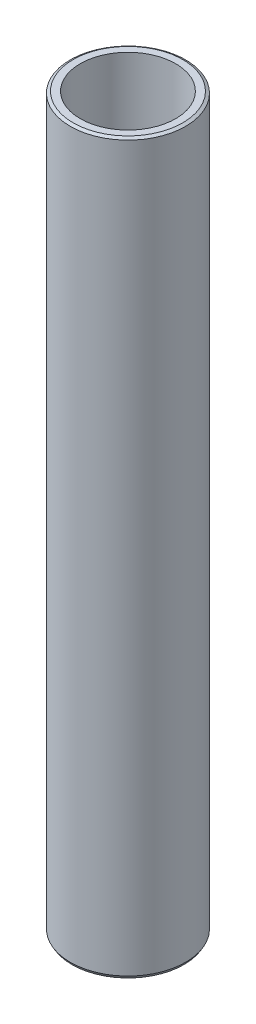
ISO-10303-21;
HEADER;
FILE_DESCRIPTION(('STEP AP214'),'2;1');
FILE_NAME('part.step','',(''),(''),'','','');
FILE_SCHEMA(('AUTOMOTIVE_DESIGN { 1 0 10303 214 1 1 1 1 }'));
ENDSEC;
DATA;
#1=APPLICATION_CONTEXT('core data for automotive mechanical design processes');
#2=APPLICATION_PROTOCOL_DEFINITION('international standard','automotive_design',2000,#1);
#3=PRODUCT_CONTEXT('',#1,'mechanical');
#4=PRODUCT('Part','Part','',(#3));
#5=PRODUCT_RELATED_PRODUCT_CATEGORY('part','',(#4));
#6=PRODUCT_DEFINITION_FORMATION('','',#4);
#7=PRODUCT_DEFINITION_CONTEXT('part definition',#1,'design');
#8=PRODUCT_DEFINITION('design','',#6,#7);
#9=PRODUCT_DEFINITION_SHAPE('','',#8);
#10=(LENGTH_UNIT() NAMED_UNIT(*) SI_UNIT(.MILLI.,.METRE.));
#11=(NAMED_UNIT(*) PLANE_ANGLE_UNIT() SI_UNIT($,.RADIAN.));
#12=(NAMED_UNIT(*) SI_UNIT($,.STERADIAN.) SOLID_ANGLE_UNIT());
#13=UNCERTAINTY_MEASURE_WITH_UNIT(LENGTH_MEASURE(1.E-05),#10,'distance_accuracy_value','');
#14=(GEOMETRIC_REPRESENTATION_CONTEXT(3) GLOBAL_UNCERTAINTY_ASSIGNED_CONTEXT((#13)) GLOBAL_UNIT_ASSIGNED_CONTEXT((#10,
#11,#12)) REPRESENTATION_CONTEXT('',''));
#15=CARTESIAN_POINT('',(0.,0.,0.));
#16=DIRECTION('',(0.,0.,1.));
#17=DIRECTION('',(1.,0.,0.));
#18=AXIS2_PLACEMENT_3D('',#15,#16,#17);
#19=CARTESIAN_POINT('',(0.,600.,0.));
#20=DIRECTION('',(0.,-1.,0.));
#21=DIRECTION('',(0.,0.,-1.));
#22=AXIS2_PLACEMENT_3D('',#19,#20,#21);
#23=CYLINDRICAL_SURFACE('',#22,47.5);
#24=CARTESIAN_POINT('',(0.,598.645464286996,0.));
#25=DIRECTION('',(0.,1.,0.));
#26=DIRECTION('',(0.,0.,1.));
#27=AXIS2_PLACEMENT_3D('',#24,#25,#26);
#28=CIRCLE('',#27,47.5);
#29=CARTESIAN_POINT('',(0.,598.645464286996,47.5));
#30=VERTEX_POINT('',#29);
#31=EDGE_CURVE('E50',#30,#30,#28,.F.);
#32=ORIENTED_EDGE('',*,*,#31,.T.);
#33=EDGE_LOOP('',(#32));
#34=FACE_BOUND('',#33,.T.);
#35=CARTESIAN_POINT('',(0.,2.34612467558948,0.));
#36=DIRECTION('',(0.,1.,0.));
#37=DIRECTION('',(0.,0.,1.));
#38=AXIS2_PLACEMENT_3D('',#35,#36,#37);
#39=CIRCLE('',#38,47.5);
#40=CARTESIAN_POINT('',(0.,2.34612467558948,47.5));
#41=VERTEX_POINT('',#40);
#42=EDGE_CURVE('E51',#41,#41,#39,.T.);
#43=ORIENTED_EDGE('',*,*,#42,.T.);
#44=EDGE_LOOP('',(#43));
#45=FACE_BOUND('',#44,.T.);
#46=ADVANCED_FACE('F39',(#34,#45),#23,.T.);
#47=CARTESIAN_POINT('',(0.,600.,0.));
#48=DIRECTION('',(0.,1.,0.));
#49=DIRECTION('',(0.,0.,1.));
#50=AXIS2_PLACEMENT_3D('',#47,#48,#49);
#51=PLANE('',#50);
#52=CARTESIAN_POINT('',(0.,600.,0.));
#53=DIRECTION('',(0.,1.,0.));
#54=DIRECTION('',(0.,0.,1.));
#55=AXIS2_PLACEMENT_3D('',#52,#53,#54);
#56=CIRCLE('',#55,45.1538753244102);
#57=CARTESIAN_POINT('',(0.,600.,45.1538753244102));
#58=VERTEX_POINT('',#57);
#59=EDGE_CURVE('E54',#58,#58,#56,.T.);
#60=ORIENTED_EDGE('',*,*,#59,.T.);
#61=EDGE_LOOP('',(#60));
#62=FACE_BOUND('',#61,.T.);
#63=CARTESIAN_POINT('',(0.,600.,0.));
#64=DIRECTION('',(0.,1.,0.));
#65=DIRECTION('',(0.,0.,1.));
#66=AXIS2_PLACEMENT_3D('',#63,#64,#65);
#67=CIRCLE('',#66,39.2832958778818);
#68=CARTESIAN_POINT('',(0.,600.,39.2832958778818));
#69=VERTEX_POINT('',#68);
#70=EDGE_CURVE('E58',#69,#69,#67,.T.);
#71=ORIENTED_EDGE('',*,*,#70,.F.);
#72=EDGE_LOOP('',(#71));
#73=FACE_BOUND('',#72,.T.);
#74=ADVANCED_FACE('F69',(#62,#73),#51,.T.);
#75=CARTESIAN_POINT('',(0.,0.,0.));
#76=DIRECTION('',(0.,1.,0.));
#77=DIRECTION('',(0.,0.,1.));
#78=AXIS2_PLACEMENT_3D('',#75,#76,#77);
#79=PLANE('',#78);
#80=CARTESIAN_POINT('',(0.,0.,0.));
#81=DIRECTION('',(0.,1.,0.));
#82=DIRECTION('',(0.,0.,1.));
#83=AXIS2_PLACEMENT_3D('',#80,#81,#82);
#84=CIRCLE('',#83,46.145464286996);
#85=CARTESIAN_POINT('',(0.,0.,46.145464286996));
#86=VERTEX_POINT('',#85);
#87=EDGE_CURVE('E10',#86,#86,#84,.F.);
#88=ORIENTED_EDGE('',*,*,#87,.T.);
#89=EDGE_LOOP('',(#88));
#90=FACE_BOUND('',#89,.T.);
#91=CARTESIAN_POINT('',(0.,0.,0.));
#92=DIRECTION('',(0.,1.,0.));
#93=DIRECTION('',(0.,0.,1.));
#94=AXIS2_PLACEMENT_3D('',#91,#92,#93);
#95=CIRCLE('',#94,39.2832958778818);
#96=CARTESIAN_POINT('',(0.,0.,39.2832958778818));
#97=VERTEX_POINT('',#96);
#98=EDGE_CURVE('E63',#97,#97,#95,.T.);
#99=ORIENTED_EDGE('',*,*,#98,.T.);
#100=EDGE_LOOP('',(#99));
#101=FACE_BOUND('',#100,.T.);
#102=ADVANCED_FACE('F75',(#90,#101),#79,.F.);
#103=CARTESIAN_POINT('',(0.,600.,0.));
#104=DIRECTION('',(0.,-1.,0.));
#105=DIRECTION('',(0.,0.,-1.));
#106=AXIS2_PLACEMENT_3D('',#103,#104,#105);
#107=CYLINDRICAL_SURFACE('',#106,39.2832958778818);
#108=ORIENTED_EDGE('',*,*,#70,.T.);
#109=EDGE_LOOP('',(#108));
#110=FACE_BOUND('',#109,.T.);
#111=ORIENTED_EDGE('',*,*,#98,.F.);
#112=EDGE_LOOP('',(#111));
#113=FACE_BOUND('',#112,.T.);
#114=ADVANCED_FACE('F70',(#110,#113),#107,.F.);
#115=CARTESIAN_POINT('',(0.,600.,0.));
#116=DIRECTION('',(0.,-1.,0.));
#117=DIRECTION('',(0.,0.,-1.));
#118=AXIS2_PLACEMENT_3D('',#115,#116,#117);
#119=CONICAL_SURFACE('',#118,45.1538753244102,1.04719755119658);
#120=ORIENTED_EDGE('',*,*,#31,.F.);
#121=EDGE_LOOP('',(#120));
#122=FACE_BOUND('',#121,.T.);
#123=ORIENTED_EDGE('',*,*,#59,.F.);
#124=EDGE_LOOP('',(#123));
#125=FACE_BOUND('',#124,.T.);
#126=ADVANCED_FACE('F81',(#122,#125),#119,.T.);
#127=CARTESIAN_POINT('',(0.,2.34612467558948,0.));
#128=DIRECTION('',(0.,1.,0.));
#129=DIRECTION('',(0.,0.,1.));
#130=AXIS2_PLACEMENT_3D('',#127,#128,#129);
#131=CONICAL_SURFACE('',#130,47.5,0.523598775598314);
#132=ORIENTED_EDGE('',*,*,#87,.F.);
#133=EDGE_LOOP('',(#132));
#134=FACE_BOUND('',#133,.T.);
#135=ORIENTED_EDGE('',*,*,#42,.F.);
#136=EDGE_LOOP('',(#135));
#137=FACE_BOUND('',#136,.T.);
#138=ADVANCED_FACE('F45',(#134,#137),#131,.T.);
#139=CLOSED_SHELL('',(#46,#74,#102,#114,#126,#138));
#140=MANIFOLD_SOLID_BREP('B2',#139);
#141=ADVANCED_BREP_SHAPE_REPRESENTATION('',(#18,#140),#14);
#142=SHAPE_DEFINITION_REPRESENTATION(#9,#141);
ENDSEC;
END-ISO-10303-21;
